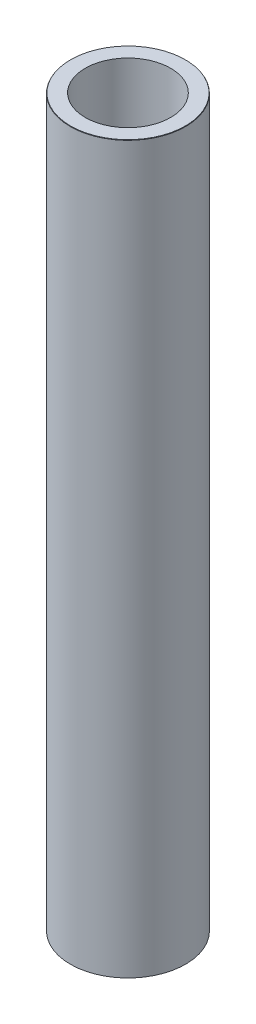
ISO-10303-21;
HEADER;
FILE_DESCRIPTION(('STEP AP214'),'2;1');
FILE_NAME('part.step','',(''),(''),'','','');
FILE_SCHEMA(('AUTOMOTIVE_DESIGN { 1 0 10303 214 1 1 1 1 }'));
ENDSEC;
DATA;
#1=APPLICATION_CONTEXT('core data for automotive mechanical design processes');
#2=APPLICATION_PROTOCOL_DEFINITION('international standard','automotive_design',2000,#1);
#3=PRODUCT_CONTEXT('',#1,'mechanical');
#4=PRODUCT('Part','Part','',(#3));
#5=PRODUCT_RELATED_PRODUCT_CATEGORY('part','',(#4));
#6=PRODUCT_DEFINITION_FORMATION('','',#4);
#7=PRODUCT_DEFINITION_CONTEXT('part definition',#1,'design');
#8=PRODUCT_DEFINITION('design','',#6,#7);
#9=PRODUCT_DEFINITION_SHAPE('','',#8);
#10=(LENGTH_UNIT() NAMED_UNIT(*) SI_UNIT(.MILLI.,.METRE.));
#11=(NAMED_UNIT(*) PLANE_ANGLE_UNIT() SI_UNIT($,.RADIAN.));
#12=(NAMED_UNIT(*) SI_UNIT($,.STERADIAN.) SOLID_ANGLE_UNIT());
#13=UNCERTAINTY_MEASURE_WITH_UNIT(LENGTH_MEASURE(1.E-05),#10,'distance_accuracy_value','');
#14=(GEOMETRIC_REPRESENTATION_CONTEXT(3) GLOBAL_UNCERTAINTY_ASSIGNED_CONTEXT((#13)) GLOBAL_UNIT_ASSIGNED_CONTEXT((#10,
#11,#12)) REPRESENTATION_CONTEXT('',''));
#15=CARTESIAN_POINT('',(0.,0.,0.));
#16=DIRECTION('',(0.,0.,1.));
#17=DIRECTION('',(1.,0.,0.));
#18=AXIS2_PLACEMENT_3D('',#15,#16,#17);
#19=CARTESIAN_POINT('',(0.,409.530352015598,0.));
#20=DIRECTION('',(0.,-1.,0.));
#21=DIRECTION('',(0.,0.,-1.));
#22=AXIS2_PLACEMENT_3D('',#19,#20,#21);
#23=CYLINDRICAL_SURFACE('',#22,32.5);
#24=CARTESIAN_POINT('',(0.,409.301692135304,0.));
#25=DIRECTION('',(0.,1.,0.));
#26=DIRECTION('',(0.,0.,1.));
#27=AXIS2_PLACEMENT_3D('',#24,#25,#26);
#28=CIRCLE('',#27,32.5);
#29=CARTESIAN_POINT('',(0.,409.301692135304,32.5));
#30=VERTEX_POINT('',#29);
#31=EDGE_CURVE('E50',#30,#30,#28,.F.);
#32=ORIENTED_EDGE('',*,*,#31,.T.);
#33=EDGE_LOOP('',(#32));
#34=FACE_BOUND('',#33,.T.);
#35=CARTESIAN_POINT('',(0.,0.132016843440774,0.));
#36=DIRECTION('',(0.,1.,0.));
#37=DIRECTION('',(0.,0.,1.));
#38=AXIS2_PLACEMENT_3D('',#35,#36,#37);
#39=CIRCLE('',#38,32.5);
#40=CARTESIAN_POINT('',(0.,0.132016843440774,32.5));
#41=VERTEX_POINT('',#40);
#42=EDGE_CURVE('E51',#41,#41,#39,.T.);
#43=ORIENTED_EDGE('',*,*,#42,.T.);
#44=EDGE_LOOP('',(#43));
#45=FACE_BOUND('',#44,.T.);
#46=ADVANCED_FACE('F39',(#34,#45),#23,.T.);
#47=CARTESIAN_POINT('',(0.,409.530352015598,0.));
#48=DIRECTION('',(0.,1.,0.));
#49=DIRECTION('',(0.,0.,1.));
#50=AXIS2_PLACEMENT_3D('',#47,#48,#49);
#51=PLANE('',#50);
#52=CARTESIAN_POINT('',(0.,409.530352015598,0.));
#53=DIRECTION('',(0.,1.,0.));
#54=DIRECTION('',(0.,0.,1.));
#55=AXIS2_PLACEMENT_3D('',#52,#53,#54);
#56=CIRCLE('',#55,32.3679831565593);
#57=CARTESIAN_POINT('',(0.,409.530352015598,32.3679831565593));
#58=VERTEX_POINT('',#57);
#59=EDGE_CURVE('E54',#58,#58,#56,.T.);
#60=ORIENTED_EDGE('',*,*,#59,.T.);
#61=EDGE_LOOP('',(#60));
#62=FACE_BOUND('',#61,.T.);
#63=CARTESIAN_POINT('',(0.,409.530352015598,0.));
#64=DIRECTION('',(0.,1.,0.));
#65=DIRECTION('',(0.,0.,1.));
#66=AXIS2_PLACEMENT_3D('',#63,#64,#65);
#67=CIRCLE('',#66,24.0855013960802);
#68=CARTESIAN_POINT('',(0.,409.530352015598,24.0855013960802));
#69=VERTEX_POINT('',#68);
#70=EDGE_CURVE('E58',#69,#69,#67,.T.);
#71=ORIENTED_EDGE('',*,*,#70,.F.);
#72=EDGE_LOOP('',(#71));
#73=FACE_BOUND('',#72,.T.);
#74=ADVANCED_FACE('F69',(#62,#73),#51,.T.);
#75=CARTESIAN_POINT('',(0.,0.,0.));
#76=DIRECTION('',(0.,1.,0.));
#77=DIRECTION('',(0.,0.,1.));
#78=AXIS2_PLACEMENT_3D('',#75,#76,#77);
#79=PLANE('',#78);
#80=CARTESIAN_POINT('',(0.,0.,0.));
#81=DIRECTION('',(0.,1.,0.));
#82=DIRECTION('',(0.,0.,1.));
#83=AXIS2_PLACEMENT_3D('',#80,#81,#82);
#84=CIRCLE('',#83,32.2713401197057);
#85=CARTESIAN_POINT('',(0.,0.,32.2713401197057));
#86=VERTEX_POINT('',#85);
#87=EDGE_CURVE('E10',#86,#86,#84,.F.);
#88=ORIENTED_EDGE('',*,*,#87,.T.);
#89=EDGE_LOOP('',(#88));
#90=FACE_BOUND('',#89,.T.);
#91=CARTESIAN_POINT('',(0.,0.,0.));
#92=DIRECTION('',(0.,1.,0.));
#93=DIRECTION('',(0.,0.,1.));
#94=AXIS2_PLACEMENT_3D('',#91,#92,#93);
#95=CIRCLE('',#94,24.0855013960802);
#96=CARTESIAN_POINT('',(0.,0.,24.0855013960802));
#97=VERTEX_POINT('',#96);
#98=EDGE_CURVE('E63',#97,#97,#95,.T.);
#99=ORIENTED_EDGE('',*,*,#98,.T.);
#100=EDGE_LOOP('',(#99));
#101=FACE_BOUND('',#100,.T.);
#102=ADVANCED_FACE('F75',(#90,#101),#79,.F.);
#103=CARTESIAN_POINT('',(0.,409.530352015598,0.));
#104=DIRECTION('',(0.,-1.,0.));
#105=DIRECTION('',(0.,0.,-1.));
#106=AXIS2_PLACEMENT_3D('',#103,#104,#105);
#107=CYLINDRICAL_SURFACE('',#106,24.0855013960802);
#108=ORIENTED_EDGE('',*,*,#70,.T.);
#109=EDGE_LOOP('',(#108));
#110=FACE_BOUND('',#109,.T.);
#111=ORIENTED_EDGE('',*,*,#98,.F.);
#112=EDGE_LOOP('',(#111));
#113=FACE_BOUND('',#112,.T.);
#114=ADVANCED_FACE('F70',(#110,#113),#107,.F.);
#115=CARTESIAN_POINT('',(0.,409.530352015598,0.));
#116=DIRECTION('',(0.,-1.,0.));
#117=DIRECTION('',(0.,0.,-1.));
#118=AXIS2_PLACEMENT_3D('',#115,#116,#117);
#119=CONICAL_SURFACE('',#118,32.3679831565593,0.523598775598194);
#120=ORIENTED_EDGE('',*,*,#31,.F.);
#121=EDGE_LOOP('',(#120));
#122=FACE_BOUND('',#121,.T.);
#123=ORIENTED_EDGE('',*,*,#59,.F.);
#124=EDGE_LOOP('',(#123));
#125=FACE_BOUND('',#124,.T.);
#126=ADVANCED_FACE('F81',(#122,#125),#119,.T.);
#127=CARTESIAN_POINT('',(0.,0.132016843440774,0.));
#128=DIRECTION('',(0.,1.,0.));
#129=DIRECTION('',(0.,0.,1.));
#130=AXIS2_PLACEMENT_3D('',#127,#128,#129);
#131=CONICAL_SURFACE('',#130,32.5,1.04719755119657);
#132=ORIENTED_EDGE('',*,*,#87,.F.);
#133=EDGE_LOOP('',(#132));
#134=FACE_BOUND('',#133,.T.);
#135=ORIENTED_EDGE('',*,*,#42,.F.);
#136=EDGE_LOOP('',(#135));
#137=FACE_BOUND('',#136,.T.);
#138=ADVANCED_FACE('F45',(#134,#137),#131,.T.);
#139=CLOSED_SHELL('',(#46,#74,#102,#114,#126,#138));
#140=MANIFOLD_SOLID_BREP('B2',#139);
#141=ADVANCED_BREP_SHAPE_REPRESENTATION('',(#18,#140),#14);
#142=SHAPE_DEFINITION_REPRESENTATION(#9,#141);
ENDSEC;
END-ISO-10303-21;
